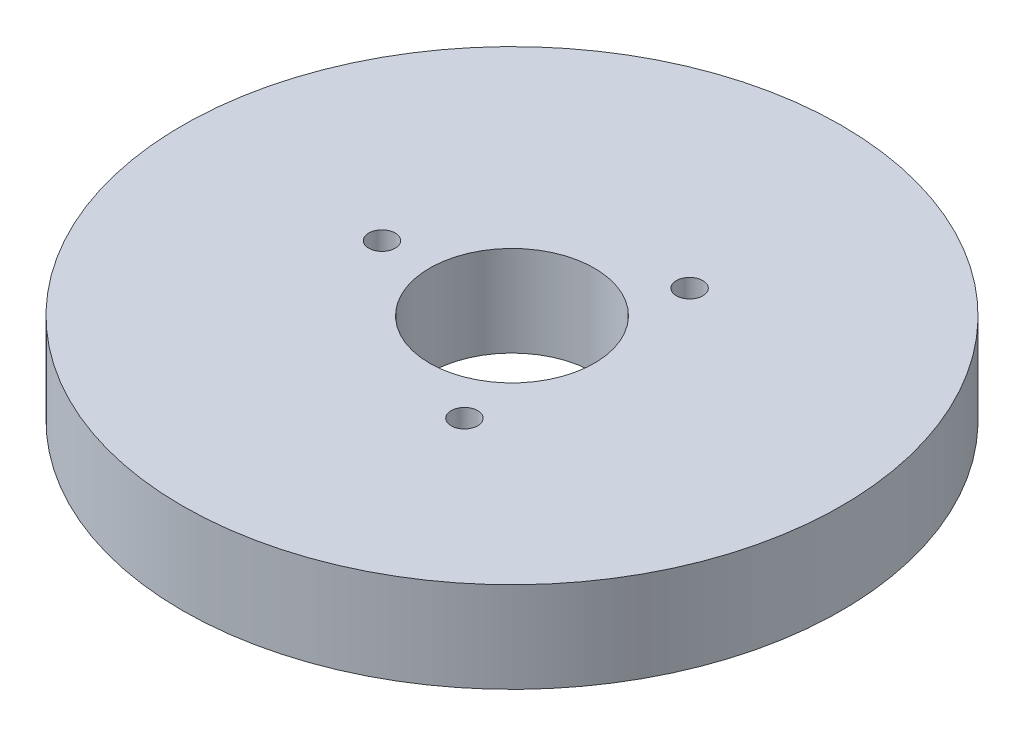
ISO-10303-21;
HEADER;
FILE_DESCRIPTION(('STEP AP214'),'2;1');
FILE_NAME('part.step','',(''),(''),'','','');
FILE_SCHEMA(('AUTOMOTIVE_DESIGN { 1 0 10303 214 1 1 1 1 }'));
ENDSEC;
DATA;
#1=APPLICATION_CONTEXT('core data for automotive mechanical design processes');
#2=APPLICATION_PROTOCOL_DEFINITION('international standard','automotive_design',2000,#1);
#3=PRODUCT_CONTEXT('',#1,'mechanical');
#4=PRODUCT('Part','Part','',(#3));
#5=PRODUCT_RELATED_PRODUCT_CATEGORY('part','',(#4));
#6=PRODUCT_DEFINITION_FORMATION('','',#4);
#7=PRODUCT_DEFINITION_CONTEXT('part definition',#1,'design');
#8=PRODUCT_DEFINITION('design','',#6,#7);
#9=PRODUCT_DEFINITION_SHAPE('','',#8);
#10=(LENGTH_UNIT() NAMED_UNIT(*) SI_UNIT(.MILLI.,.METRE.));
#11=(NAMED_UNIT(*) PLANE_ANGLE_UNIT() SI_UNIT($,.RADIAN.));
#12=(NAMED_UNIT(*) SI_UNIT($,.STERADIAN.) SOLID_ANGLE_UNIT());
#13=UNCERTAINTY_MEASURE_WITH_UNIT(LENGTH_MEASURE(1.E-05),#10,'distance_accuracy_value','');
#14=(GEOMETRIC_REPRESENTATION_CONTEXT(3) GLOBAL_UNCERTAINTY_ASSIGNED_CONTEXT((#13)) GLOBAL_UNIT_ASSIGNED_CONTEXT((#10,
#11,#12)) REPRESENTATION_CONTEXT('',''));
#15=CARTESIAN_POINT('',(0.,0.,0.));
#16=DIRECTION('',(0.,0.,1.));
#17=DIRECTION('',(1.,0.,0.));
#18=AXIS2_PLACEMENT_3D('',#15,#16,#17);
#19=CARTESIAN_POINT('',(0.,11.,0.));
#20=DIRECTION('',(0.,-1.,0.));
#21=DIRECTION('',(0.,0.,-1.));
#22=AXIS2_PLACEMENT_3D('',#19,#20,#21);
#23=CYLINDRICAL_SURFACE('',#22,40.);
#24=CARTESIAN_POINT('',(0.,11.,0.));
#25=DIRECTION('',(0.,1.,0.));
#26=DIRECTION('',(0.,0.,1.));
#27=AXIS2_PLACEMENT_3D('',#24,#25,#26);
#28=CIRCLE('',#27,40.);
#29=CARTESIAN_POINT('',(0.,11.,40.));
#30=VERTEX_POINT('',#29);
#31=EDGE_CURVE('E10',#30,#30,#28,.T.);
#32=ORIENTED_EDGE('',*,*,#31,.F.);
#33=EDGE_LOOP('',(#32));
#34=FACE_BOUND('',#33,.T.);
#35=CARTESIAN_POINT('',(0.,0.,0.));
#36=DIRECTION('',(0.,1.,0.));
#37=DIRECTION('',(0.,0.,1.));
#38=AXIS2_PLACEMENT_3D('',#35,#36,#37);
#39=CIRCLE('',#38,40.);
#40=CARTESIAN_POINT('',(0.,0.,40.));
#41=VERTEX_POINT('',#40);
#42=EDGE_CURVE('E37',#41,#41,#39,.T.);
#43=ORIENTED_EDGE('',*,*,#42,.T.);
#44=EDGE_LOOP('',(#43));
#45=FACE_BOUND('',#44,.T.);
#46=ADVANCED_FACE('F40',(#34,#45),#23,.T.);
#47=CARTESIAN_POINT('',(0.,11.,0.));
#48=DIRECTION('',(0.,1.,0.));
#49=DIRECTION('',(0.,0.,1.));
#50=AXIS2_PLACEMENT_3D('',#47,#48,#49);
#51=PLANE('',#50);
#52=CARTESIAN_POINT('',(7.89043432907225,11.,13.6666331517386));
#53=DIRECTION('',(0.,1.,0.));
#54=DIRECTION('',(0.866025403784436,0.,-0.500000000000004));
#55=AXIS2_PLACEMENT_3D('',#52,#53,#54);
#56=CIRCLE('',#55,1.60476932417609);
#57=CARTESIAN_POINT('',(9.28020533102272,11.,12.8642484896506));
#58=VERTEX_POINT('',#57);
#59=EDGE_CURVE('E70',#58,#58,#56,.T.);
#60=ORIENTED_EDGE('',*,*,#59,.F.);
#61=EDGE_LOOP('',(#60));
#62=FACE_BOUND('',#61,.T.);
#63=CARTESIAN_POINT('',(7.89043432907206,11.,-13.6666331517387));
#64=DIRECTION('',(0.,1.,0.));
#65=DIRECTION('',(-0.866025403784443,0.,-0.499999999999992));
#66=AXIS2_PLACEMENT_3D('',#63,#64,#65);
#67=CIRCLE('',#66,1.60476932417609);
#68=CARTESIAN_POINT('',(6.50066332712157,11.,-14.4690178138268));
#69=VERTEX_POINT('',#68);
#70=EDGE_CURVE('E61',#69,#69,#67,.T.);
#71=ORIENTED_EDGE('',*,*,#70,.F.);
#72=EDGE_LOOP('',(#71));
#73=FACE_BOUND('',#72,.T.);
#74=CARTESIAN_POINT('',(-15.7808686581444,11.,0.));
#75=DIRECTION('',(0.,1.,0.));
#76=DIRECTION('',(0.,0.,1.));
#77=AXIS2_PLACEMENT_3D('',#74,#75,#76);
#78=CIRCLE('',#77,1.60476932417609);
#79=CARTESIAN_POINT('',(-15.7808686581444,11.,1.60476932417609));
#80=VERTEX_POINT('',#79);
#81=EDGE_CURVE('E54',#80,#80,#78,.T.);
#82=ORIENTED_EDGE('',*,*,#81,.F.);
#83=EDGE_LOOP('',(#82));
#84=FACE_BOUND('',#83,.T.);
#85=CARTESIAN_POINT('',(0.,11.,0.));
#86=DIRECTION('',(0.,1.,0.));
#87=DIRECTION('',(0.,0.,1.));
#88=AXIS2_PLACEMENT_3D('',#85,#86,#87);
#89=CIRCLE('',#88,10.);
#90=CARTESIAN_POINT('',(0.,11.,10.));
#91=VERTEX_POINT('',#90);
#92=EDGE_CURVE('E50',#91,#91,#89,.T.);
#93=ORIENTED_EDGE('',*,*,#92,.F.);
#94=EDGE_LOOP('',(#93));
#95=FACE_BOUND('',#94,.T.);
#96=ORIENTED_EDGE('',*,*,#31,.T.);
#97=EDGE_LOOP('',(#96));
#98=FACE_BOUND('',#97,.T.);
#99=ADVANCED_FACE('F85',(#62,#73,#84,#95,#98),#51,.T.);
#100=CARTESIAN_POINT('',(0.,0.,0.));
#101=DIRECTION('',(0.,1.,0.));
#102=DIRECTION('',(0.,0.,1.));
#103=AXIS2_PLACEMENT_3D('',#100,#101,#102);
#104=PLANE('',#103);
#105=CARTESIAN_POINT('',(0.,0.,0.));
#106=DIRECTION('',(0.,1.,0.));
#107=DIRECTION('',(0.,0.,1.));
#108=AXIS2_PLACEMENT_3D('',#105,#106,#107);
#109=CIRCLE('',#108,10.);
#110=CARTESIAN_POINT('',(0.,0.,10.));
#111=VERTEX_POINT('',#110);
#112=EDGE_CURVE('E47',#111,#111,#109,.T.);
#113=ORIENTED_EDGE('',*,*,#112,.T.);
#114=EDGE_LOOP('',(#113));
#115=FACE_BOUND('',#114,.T.);
#116=ORIENTED_EDGE('',*,*,#42,.F.);
#117=EDGE_LOOP('',(#116));
#118=FACE_BOUND('',#117,.T.);
#119=ADVANCED_FACE('F84',(#115,#118),#104,.F.);
#120=CARTESIAN_POINT('',(0.,11.,0.));
#121=DIRECTION('',(0.,-1.,0.));
#122=DIRECTION('',(0.,0.,-1.));
#123=AXIS2_PLACEMENT_3D('',#120,#121,#122);
#124=CYLINDRICAL_SURFACE('',#123,10.);
#125=ORIENTED_EDGE('',*,*,#92,.T.);
#126=EDGE_LOOP('',(#125));
#127=FACE_BOUND('',#126,.T.);
#128=ORIENTED_EDGE('',*,*,#112,.F.);
#129=EDGE_LOOP('',(#128));
#130=FACE_BOUND('',#129,.T.);
#131=ADVANCED_FACE('F91',(#127,#130),#124,.F.);
#132=CARTESIAN_POINT('',(-15.7808686581444,2.38552684707329,0.));
#133=DIRECTION('',(0.,1.,0.));
#134=DIRECTION('',(0.,0.,1.));
#135=AXIS2_PLACEMENT_3D('',#132,#133,#134);
#136=CYLINDRICAL_SURFACE('',#135,1.60476932417609);
#137=CARTESIAN_POINT('',(-15.7808686581444,2.38552684707329,0.));
#138=DIRECTION('',(0.,1.,0.));
#139=DIRECTION('',(0.,0.,1.));
#140=AXIS2_PLACEMENT_3D('',#137,#138,#139);
#141=CIRCLE('',#140,1.60476932417609);
#142=CARTESIAN_POINT('',(-15.7808686581444,2.38552684707329,1.60476932417609));
#143=VERTEX_POINT('',#142);
#144=EDGE_CURVE('E55',#143,#143,#141,.T.);
#145=ORIENTED_EDGE('',*,*,#144,.F.);
#146=EDGE_LOOP('',(#145));
#147=FACE_BOUND('',#146,.T.);
#148=ORIENTED_EDGE('',*,*,#81,.T.);
#149=EDGE_LOOP('',(#148));
#150=FACE_BOUND('',#149,.T.);
#151=ADVANCED_FACE('F96',(#147,#150),#136,.F.);
#152=CARTESIAN_POINT('',(-15.7808686581444,2.38552684707329,0.));
#153=DIRECTION('',(0.,1.,0.));
#154=DIRECTION('',(0.,0.,1.));
#155=AXIS2_PLACEMENT_3D('',#152,#153,#154);
#156=PLANE('',#155);
#157=ORIENTED_EDGE('',*,*,#144,.T.);
#158=EDGE_LOOP('',(#157));
#159=FACE_BOUND('',#158,.T.);
#160=ADVANCED_FACE('F127',(#159),#156,.T.);
#161=CARTESIAN_POINT('',(7.89043432907206,2.38552684707329,-13.6666331517387));
#162=DIRECTION('',(0.,1.,0.));
#163=DIRECTION('',(0.,0.,1.));
#164=AXIS2_PLACEMENT_3D('',#161,#162,#163);
#165=CYLINDRICAL_SURFACE('',#164,1.60476932417609);
#166=CARTESIAN_POINT('',(7.89043432907206,2.38552684707329,-13.6666331517387));
#167=DIRECTION('',(0.,1.,0.));
#168=DIRECTION('',(-0.866025403784443,0.,-0.499999999999992));
#169=AXIS2_PLACEMENT_3D('',#166,#167,#168);
#170=CIRCLE('',#169,1.60476932417609);
#171=CARTESIAN_POINT('',(6.50066332712157,2.38552684707329,-14.4690178138268));
#172=VERTEX_POINT('',#171);
#173=EDGE_CURVE('E63',#172,#172,#170,.T.);
#174=ORIENTED_EDGE('',*,*,#173,.F.);
#175=EDGE_LOOP('',(#174));
#176=FACE_BOUND('',#175,.T.);
#177=ORIENTED_EDGE('',*,*,#70,.T.);
#178=EDGE_LOOP('',(#177));
#179=FACE_BOUND('',#178,.T.);
#180=ADVANCED_FACE('F133',(#176,#179),#165,.F.);
#181=CARTESIAN_POINT('',(7.89043432907206,2.38552684707329,-13.6666331517387));
#182=DIRECTION('',(0.,1.,0.));
#183=DIRECTION('',(-0.866025403784443,0.,-0.499999999999992));
#184=AXIS2_PLACEMENT_3D('',#181,#182,#183);
#185=PLANE('',#184);
#186=ORIENTED_EDGE('',*,*,#173,.T.);
#187=EDGE_LOOP('',(#186));
#188=FACE_BOUND('',#187,.T.);
#189=ADVANCED_FACE('F77',(#188),#185,.T.);
#190=CARTESIAN_POINT('',(7.89043432907225,2.38552684707329,13.6666331517386));
#191=DIRECTION('',(0.,1.,0.));
#192=DIRECTION('',(0.,0.,1.));
#193=AXIS2_PLACEMENT_3D('',#190,#191,#192);
#194=CYLINDRICAL_SURFACE('',#193,1.60476932417609);
#195=CARTESIAN_POINT('',(7.89043432907225,2.38552684707329,13.6666331517386));
#196=DIRECTION('',(0.,1.,0.));
#197=DIRECTION('',(0.866025403784436,0.,-0.500000000000004));
#198=AXIS2_PLACEMENT_3D('',#195,#196,#197);
#199=CIRCLE('',#198,1.60476932417609);
#200=CARTESIAN_POINT('',(9.28020533102272,2.38552684707329,12.8642484896506));
#201=VERTEX_POINT('',#200);
#202=EDGE_CURVE('E59',#201,#201,#199,.T.);
#203=ORIENTED_EDGE('',*,*,#202,.F.);
#204=EDGE_LOOP('',(#203));
#205=FACE_BOUND('',#204,.T.);
#206=ORIENTED_EDGE('',*,*,#59,.T.);
#207=EDGE_LOOP('',(#206));
#208=FACE_BOUND('',#207,.T.);
#209=ADVANCED_FACE('F73',(#205,#208),#194,.F.);
#210=CARTESIAN_POINT('',(7.89043432907225,2.38552684707329,13.6666331517386));
#211=DIRECTION('',(0.,1.,0.));
#212=DIRECTION('',(0.866025403784436,0.,-0.500000000000004));
#213=AXIS2_PLACEMENT_3D('',#210,#211,#212);
#214=PLANE('',#213);
#215=ORIENTED_EDGE('',*,*,#202,.T.);
#216=EDGE_LOOP('',(#215));
#217=FACE_BOUND('',#216,.T.);
#218=ADVANCED_FACE('F71',(#217),#214,.T.);
#219=CLOSED_SHELL('',(#46,#99,#119,#131,#151,#160,#180,#189,#209,#218));
#220=MANIFOLD_SOLID_BREP('B2',#219);
#221=ADVANCED_BREP_SHAPE_REPRESENTATION('',(#18,#220),#14);
#222=SHAPE_DEFINITION_REPRESENTATION(#9,#221);
ENDSEC;
END-ISO-10303-21;
